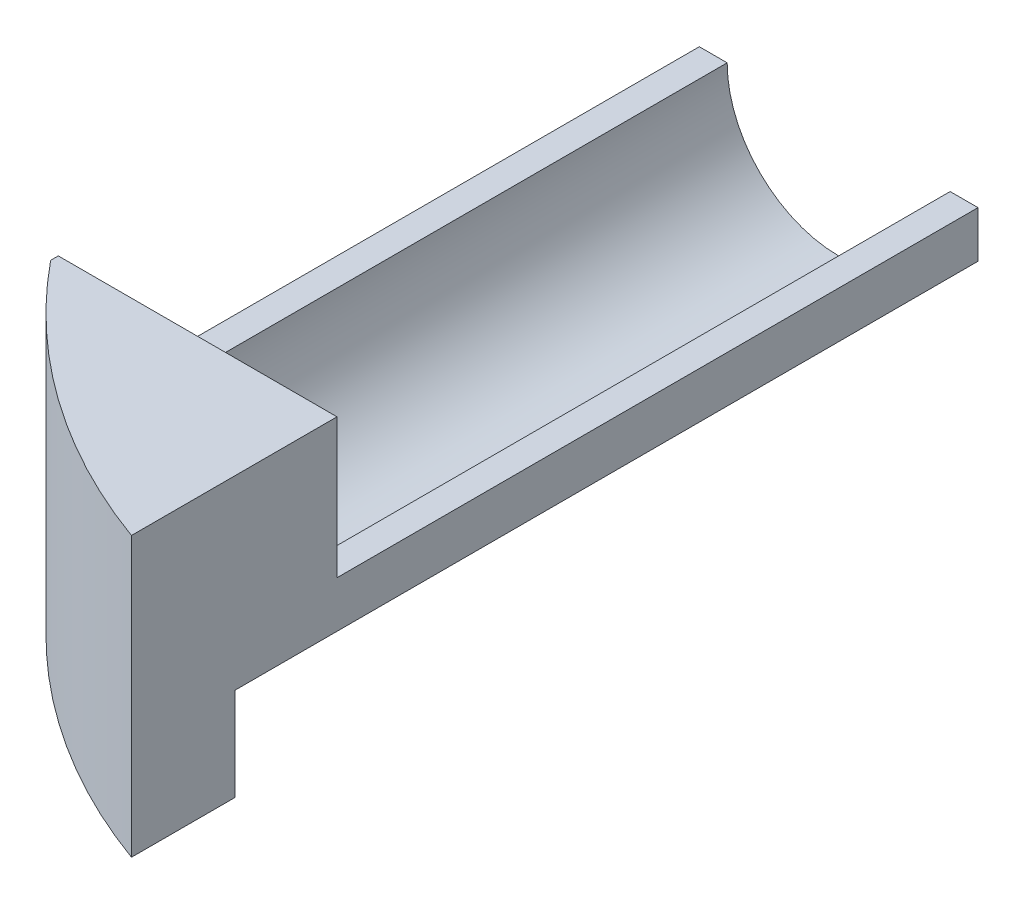
ISO-10303-21;
HEADER;
FILE_DESCRIPTION(('STEP AP214'),'2;1');
FILE_NAME('part.step','',(''),(''),'','','');
FILE_SCHEMA(('AUTOMOTIVE_DESIGN { 1 0 10303 214 1 1 1 1 }'));
ENDSEC;
DATA;
#1=APPLICATION_CONTEXT('core data for automotive mechanical design processes');
#2=APPLICATION_PROTOCOL_DEFINITION('international standard','automotive_design',2000,#1);
#3=PRODUCT_CONTEXT('',#1,'mechanical');
#4=PRODUCT('Part','Part','',(#3));
#5=PRODUCT_RELATED_PRODUCT_CATEGORY('part','',(#4));
#6=PRODUCT_DEFINITION_FORMATION('','',#4);
#7=PRODUCT_DEFINITION_CONTEXT('part definition',#1,'design');
#8=PRODUCT_DEFINITION('design','',#6,#7);
#9=PRODUCT_DEFINITION_SHAPE('','',#8);
#10=(LENGTH_UNIT() NAMED_UNIT(*) SI_UNIT(.MILLI.,.METRE.));
#11=(NAMED_UNIT(*) PLANE_ANGLE_UNIT() SI_UNIT($,.RADIAN.));
#12=(NAMED_UNIT(*) SI_UNIT($,.STERADIAN.) SOLID_ANGLE_UNIT());
#13=UNCERTAINTY_MEASURE_WITH_UNIT(LENGTH_MEASURE(1.E-05),#10,'distance_accuracy_value','');
#14=(GEOMETRIC_REPRESENTATION_CONTEXT(3) GLOBAL_UNCERTAINTY_ASSIGNED_CONTEXT((#13)) GLOBAL_UNIT_ASSIGNED_CONTEXT((#10,
#11,#12)) REPRESENTATION_CONTEXT('',''));
#15=CARTESIAN_POINT('',(0.,0.,0.));
#16=DIRECTION('',(0.,0.,1.));
#17=DIRECTION('',(1.,0.,0.));
#18=AXIS2_PLACEMENT_3D('',#15,#16,#17);
#19=CARTESIAN_POINT('',(-30.,30.,100.));
#20=DIRECTION('',(0.,-1.,0.));
#21=DIRECTION('',(0.,0.,-1.));
#22=AXIS2_PLACEMENT_3D('',#19,#20,#21);
#23=PLANE('',#22);
#24=DIRECTION('',(1.,0.,0.));
#25=VECTOR('',#24,1.);
#26=CARTESIAN_POINT('',(0.,30.,69.));
#27=LINE('',#26,#25);
#28=CARTESIAN_POINT('',(-30.,30.,69.));
#29=VERTEX_POINT('',#28);
#30=CARTESIAN_POINT('',(0.,30.,69.));
#31=VERTEX_POINT('',#30);
#32=EDGE_CURVE('E166',#29,#31,#27,.T.);
#33=ORIENTED_EDGE('',*,*,#32,.F.);
#34=DIRECTION('',(0.,0.,-1.));
#35=VECTOR('',#34,1.);
#36=CARTESIAN_POINT('',(-30.,30.,100.));
#37=LINE('',#36,#35);
#38=CARTESIAN_POINT('',(-30.,30.,69.8246485929605));
#39=VERTEX_POINT('',#38);
#40=EDGE_CURVE('E55',#39,#29,#37,.T.);
#41=ORIENTED_EDGE('',*,*,#40,.F.);
#42=CARTESIAN_POINT('',(23.5,30.,26.25));
#43=DIRECTION('',(0.,-1.,0.));
#44=DIRECTION('',(1.,0.,0.));
#45=AXIS2_PLACEMENT_3D('',#42,#43,#44);
#46=CIRCLE('',#45,69.);
#47=CARTESIAN_POINT('',(0.,30.,91.1248795759961));
#48=VERTEX_POINT('',#47);
#49=EDGE_CURVE('E199',#48,#39,#46,.T.);
#50=ORIENTED_EDGE('',*,*,#49,.F.);
#51=DIRECTION('',(0.,0.,-1.));
#52=VECTOR('',#51,1.);
#53=CARTESIAN_POINT('',(0.,30.,100.));
#54=LINE('',#53,#52);
#55=EDGE_CURVE('E12',#48,#31,#54,.T.);
#56=ORIENTED_EDGE('',*,*,#55,.T.);
#57=EDGE_LOOP('',(#33,#41,#50,#56));
#58=FACE_BOUND('',#57,.T.);
#59=ADVANCED_FACE('F46',(#58),#23,.F.);
#60=CARTESIAN_POINT('',(0.,30.,100.));
#61=DIRECTION('',(-1.,0.,0.));
#62=DIRECTION('',(0.,-1.,0.));
#63=AXIS2_PLACEMENT_3D('',#60,#61,#62);
#64=PLANE('',#63);
#65=DIRECTION('',(0.,-1.,0.));
#66=VECTOR('',#65,1.);
#67=CARTESIAN_POINT('',(0.,0.,80.));
#68=LINE('',#67,#66);
#69=CARTESIAN_POINT('',(0.,10.,80.));
#70=VERTEX_POINT('',#69);
#71=CARTESIAN_POINT('',(0.,0.,80.));
#72=VERTEX_POINT('',#71);
#73=EDGE_CURVE('E130',#70,#72,#68,.T.);
#74=ORIENTED_EDGE('',*,*,#73,.F.);
#75=DIRECTION('',(0.,0.,-1.));
#76=VECTOR('',#75,1.);
#77=CARTESIAN_POINT('',(0.,10.,80.));
#78=LINE('',#77,#76);
#79=CARTESIAN_POINT('',(0.,10.,0.));
#80=VERTEX_POINT('',#79);
#81=EDGE_CURVE('E126',#70,#80,#78,.T.);
#82=ORIENTED_EDGE('',*,*,#81,.T.);
#83=DIRECTION('',(0.,1.,0.));
#84=VECTOR('',#83,1.);
#85=CARTESIAN_POINT('',(0.,30.,0.));
#86=LINE('',#85,#84);
#87=CARTESIAN_POINT('',(0.,15.,0.));
#88=VERTEX_POINT('',#87);
#89=EDGE_CURVE('E211',#80,#88,#86,.T.);
#90=ORIENTED_EDGE('',*,*,#89,.T.);
#91=DIRECTION('',(0.,0.,-1.));
#92=VECTOR('',#91,1.);
#93=CARTESIAN_POINT('',(0.,15.,69.));
#94=LINE('',#93,#92);
#95=CARTESIAN_POINT('',(0.,15.,69.));
#96=VERTEX_POINT('',#95);
#97=EDGE_CURVE('E189',#96,#88,#94,.T.);
#98=ORIENTED_EDGE('',*,*,#97,.F.);
#99=DIRECTION('',(0.,-1.,0.));
#100=VECTOR('',#99,1.);
#101=CARTESIAN_POINT('',(0.,15.,69.));
#102=LINE('',#101,#100);
#103=EDGE_CURVE('E169',#31,#96,#102,.T.);
#104=ORIENTED_EDGE('',*,*,#103,.F.);
#105=ORIENTED_EDGE('',*,*,#55,.F.);
#106=DIRECTION('',(0.,-1.,0.));
#107=VECTOR('',#106,1.);
#108=CARTESIAN_POINT('',(0.,30.,91.1248795759961));
#109=LINE('',#108,#107);
#110=CARTESIAN_POINT('',(0.,0.,91.1248795759961));
#111=VERTEX_POINT('',#110);
#112=EDGE_CURVE('E208',#111,#48,#109,.F.);
#113=ORIENTED_EDGE('',*,*,#112,.F.);
#114=DIRECTION('',(0.,0.,-1.));
#115=VECTOR('',#114,1.);
#116=CARTESIAN_POINT('',(0.,0.,100.));
#117=LINE('',#116,#115);
#118=EDGE_CURVE('E219',#111,#72,#117,.T.);
#119=ORIENTED_EDGE('',*,*,#118,.T.);
#120=EDGE_LOOP('',(#74,#82,#90,#98,#104,#105,#113,#119));
#121=FACE_BOUND('',#120,.T.);
#122=ADVANCED_FACE('F48',(#121),#64,.F.);
#123=CARTESIAN_POINT('',(-30.,0.,100.));
#124=DIRECTION('',(1.,0.,0.));
#125=DIRECTION('',(0.,0.,-1.));
#126=AXIS2_PLACEMENT_3D('',#123,#124,#125);
#127=PLANE('',#126);
#128=DIRECTION('',(0.,1.,0.));
#129=VECTOR('',#128,1.);
#130=CARTESIAN_POINT('',(-30.,30.,69.));
#131=LINE('',#130,#129);
#132=CARTESIAN_POINT('',(-30.,15.,69.));
#133=VERTEX_POINT('',#132);
#134=EDGE_CURVE('E163',#133,#29,#131,.T.);
#135=ORIENTED_EDGE('',*,*,#134,.F.);
#136=DIRECTION('',(0.,0.,-1.));
#137=VECTOR('',#136,1.);
#138=CARTESIAN_POINT('',(-30.,15.,69.));
#139=LINE('',#138,#137);
#140=CARTESIAN_POINT('',(-30.,15.,0.));
#141=VERTEX_POINT('',#140);
#142=EDGE_CURVE('E193',#133,#141,#139,.T.);
#143=ORIENTED_EDGE('',*,*,#142,.T.);
#144=DIRECTION('',(0.,-1.,0.));
#145=VECTOR('',#144,1.);
#146=CARTESIAN_POINT('',(-30.,0.,0.));
#147=LINE('',#146,#145);
#148=CARTESIAN_POINT('',(-30.,0.,0.));
#149=VERTEX_POINT('',#148);
#150=EDGE_CURVE('E214',#141,#149,#147,.T.);
#151=ORIENTED_EDGE('',*,*,#150,.T.);
#152=DIRECTION('',(0.,0.,-1.));
#153=VECTOR('',#152,1.);
#154=CARTESIAN_POINT('',(-30.,0.,100.));
#155=LINE('',#154,#153);
#156=CARTESIAN_POINT('',(-30.,0.,69.8246485929605));
#157=VERTEX_POINT('',#156);
#158=EDGE_CURVE('E222',#157,#149,#155,.T.);
#159=ORIENTED_EDGE('',*,*,#158,.F.);
#160=DIRECTION('',(0.,-1.,0.));
#161=VECTOR('',#160,1.);
#162=CARTESIAN_POINT('',(-30.,30.,69.8246485929605));
#163=LINE('',#162,#161);
#164=EDGE_CURVE('E202',#39,#157,#163,.T.);
#165=ORIENTED_EDGE('',*,*,#164,.F.);
#166=ORIENTED_EDGE('',*,*,#40,.T.);
#167=EDGE_LOOP('',(#135,#143,#151,#159,#165,#166));
#168=FACE_BOUND('',#167,.T.);
#169=ADVANCED_FACE('F230',(#168),#127,.F.);
#170=CARTESIAN_POINT('',(0.,0.,100.));
#171=DIRECTION('',(0.,1.,0.));
#172=DIRECTION('',(-1.,0.,0.));
#173=AXIS2_PLACEMENT_3D('',#170,#171,#172);
#174=PLANE('',#173);
#175=DIRECTION('',(1.,0.,0.));
#176=VECTOR('',#175,1.);
#177=CARTESIAN_POINT('',(0.,0.,0.));
#178=LINE('',#177,#176);
#179=CARTESIAN_POINT('',(-10.,0.,0.));
#180=VERTEX_POINT('',#179);
#181=EDGE_CURVE('E145',#149,#180,#178,.T.);
#182=ORIENTED_EDGE('',*,*,#181,.T.);
#183=DIRECTION('',(0.,0.,-1.));
#184=VECTOR('',#183,1.);
#185=CARTESIAN_POINT('',(-10.,0.,80.));
#186=LINE('',#185,#184);
#187=CARTESIAN_POINT('',(-10.,0.,80.));
#188=VERTEX_POINT('',#187);
#189=EDGE_CURVE('E62',#188,#180,#186,.T.);
#190=ORIENTED_EDGE('',*,*,#189,.F.);
#191=DIRECTION('',(-1.,0.,0.));
#192=VECTOR('',#191,1.);
#193=CARTESIAN_POINT('',(-10.,0.,80.));
#194=LINE('',#193,#192);
#195=EDGE_CURVE('E131',#72,#188,#194,.T.);
#196=ORIENTED_EDGE('',*,*,#195,.F.);
#197=ORIENTED_EDGE('',*,*,#118,.F.);
#198=CARTESIAN_POINT('',(23.5,0.,26.25));
#199=DIRECTION('',(0.,-1.,0.));
#200=DIRECTION('',(1.,0.,0.));
#201=AXIS2_PLACEMENT_3D('',#198,#199,#200);
#202=CIRCLE('',#201,69.);
#203=EDGE_CURVE('E188',#111,#157,#202,.T.);
#204=ORIENTED_EDGE('',*,*,#203,.T.);
#205=ORIENTED_EDGE('',*,*,#158,.T.);
#206=EDGE_LOOP('',(#182,#190,#196,#197,#204,#205));
#207=FACE_BOUND('',#206,.T.);
#208=ADVANCED_FACE('F142',(#207),#174,.F.);
#209=CARTESIAN_POINT('',(0.,0.,0.));
#210=DIRECTION('',(0.,0.,-1.));
#211=DIRECTION('',(-1.,0.,0.));
#212=AXIS2_PLACEMENT_3D('',#209,#210,#211);
#213=PLANE('',#212);
#214=DIRECTION('',(0.707106781186547,0.707106781186548,0.));
#215=VECTOR('',#214,1.);
#216=CARTESIAN_POINT('',(0.,10.,0.));
#217=LINE('',#216,#215);
#218=EDGE_CURVE('E139',#180,#80,#217,.T.);
#219=ORIENTED_EDGE('',*,*,#218,.F.);
#220=ORIENTED_EDGE('',*,*,#181,.F.);
#221=ORIENTED_EDGE('',*,*,#150,.F.);
#222=DIRECTION('',(-1.,0.,0.));
#223=VECTOR('',#222,1.);
#224=CARTESIAN_POINT('',(-30.,15.,0.));
#225=LINE('',#224,#223);
#226=CARTESIAN_POINT('',(-27.,15.,0.));
#227=VERTEX_POINT('',#226);
#228=EDGE_CURVE('E179',#227,#141,#225,.T.);
#229=ORIENTED_EDGE('',*,*,#228,.F.);
#230=CARTESIAN_POINT('',(-15.,15.,0.));
#231=DIRECTION('',(0.,0.,-1.));
#232=DIRECTION('',(-1.,0.,0.));
#233=AXIS2_PLACEMENT_3D('',#230,#231,#232);
#234=CIRCLE('',#233,12.);
#235=CARTESIAN_POINT('',(-3.,15.,0.));
#236=VERTEX_POINT('',#235);
#237=EDGE_CURVE('E70',#236,#227,#234,.T.);
#238=ORIENTED_EDGE('',*,*,#237,.F.);
#239=DIRECTION('',(-1.,0.,0.));
#240=VECTOR('',#239,1.);
#241=CARTESIAN_POINT('',(-3.,15.,0.));
#242=LINE('',#241,#240);
#243=EDGE_CURVE('E159',#88,#236,#242,.T.);
#244=ORIENTED_EDGE('',*,*,#243,.F.);
#245=ORIENTED_EDGE('',*,*,#89,.F.);
#246=EDGE_LOOP('',(#219,#220,#221,#229,#238,#244,#245));
#247=FACE_BOUND('',#246,.T.);
#248=ADVANCED_FACE('F248',(#247),#213,.T.);
#249=CARTESIAN_POINT('',(23.5,30.,26.25));
#250=DIRECTION('',(0.,-1.,0.));
#251=DIRECTION('',(1.,0.,0.));
#252=AXIS2_PLACEMENT_3D('',#249,#250,#251);
#253=CYLINDRICAL_SURFACE('',#252,69.);
#254=ORIENTED_EDGE('',*,*,#112,.T.);
#255=ORIENTED_EDGE('',*,*,#49,.T.);
#256=ORIENTED_EDGE('',*,*,#164,.T.);
#257=ORIENTED_EDGE('',*,*,#203,.F.);
#258=EDGE_LOOP('',(#254,#255,#256,#257));
#259=FACE_BOUND('',#258,.T.);
#260=ADVANCED_FACE('F256',(#259),#253,.T.);
#261=CARTESIAN_POINT('',(-15.,15.,69.));
#262=DIRECTION('',(0.,0.,-1.));
#263=DIRECTION('',(-1.,0.,0.));
#264=AXIS2_PLACEMENT_3D('',#261,#262,#263);
#265=CYLINDRICAL_SURFACE('',#264,12.);
#266=ORIENTED_EDGE('',*,*,#237,.T.);
#267=DIRECTION('',(0.,0.,-1.));
#268=VECTOR('',#267,1.);
#269=CARTESIAN_POINT('',(-27.,15.,69.));
#270=LINE('',#269,#268);
#271=CARTESIAN_POINT('',(-27.,15.,69.));
#272=VERTEX_POINT('',#271);
#273=EDGE_CURVE('E176',#272,#227,#270,.T.);
#274=ORIENTED_EDGE('',*,*,#273,.F.);
#275=CARTESIAN_POINT('',(-15.,15.,69.));
#276=DIRECTION('',(0.,0.,-1.));
#277=DIRECTION('',(-1.,0.,0.));
#278=AXIS2_PLACEMENT_3D('',#275,#276,#277);
#279=CIRCLE('',#278,12.);
#280=CARTESIAN_POINT('',(-3.,15.,69.));
#281=VERTEX_POINT('',#280);
#282=EDGE_CURVE('E154',#281,#272,#279,.T.);
#283=ORIENTED_EDGE('',*,*,#282,.F.);
#284=DIRECTION('',(0.,0.,-1.));
#285=VECTOR('',#284,1.);
#286=CARTESIAN_POINT('',(-3.,15.,69.));
#287=LINE('',#286,#285);
#288=EDGE_CURVE('E185',#281,#236,#287,.T.);
#289=ORIENTED_EDGE('',*,*,#288,.T.);
#290=EDGE_LOOP('',(#266,#274,#283,#289));
#291=FACE_BOUND('',#290,.T.);
#292=ADVANCED_FACE('F258',(#291),#265,.F.);
#293=CARTESIAN_POINT('',(-3.,15.,69.));
#294=DIRECTION('',(0.,-1.,0.));
#295=DIRECTION('',(1.,0.,0.));
#296=AXIS2_PLACEMENT_3D('',#293,#294,#295);
#297=PLANE('',#296);
#298=ORIENTED_EDGE('',*,*,#243,.T.);
#299=ORIENTED_EDGE('',*,*,#288,.F.);
#300=DIRECTION('',(-1.,0.,0.));
#301=VECTOR('',#300,1.);
#302=CARTESIAN_POINT('',(-3.,15.,69.));
#303=LINE('',#302,#301);
#304=EDGE_CURVE('E172',#96,#281,#303,.T.);
#305=ORIENTED_EDGE('',*,*,#304,.F.);
#306=ORIENTED_EDGE('',*,*,#97,.T.);
#307=EDGE_LOOP('',(#298,#299,#305,#306));
#308=FACE_BOUND('',#307,.T.);
#309=ADVANCED_FACE('F246',(#308),#297,.F.);
#310=CARTESIAN_POINT('',(-30.,15.,69.));
#311=DIRECTION('',(0.,-1.,0.));
#312=DIRECTION('',(0.,0.,-1.));
#313=AXIS2_PLACEMENT_3D('',#310,#311,#312);
#314=PLANE('',#313);
#315=ORIENTED_EDGE('',*,*,#228,.T.);
#316=ORIENTED_EDGE('',*,*,#142,.F.);
#317=DIRECTION('',(-1.,0.,0.));
#318=VECTOR('',#317,1.);
#319=CARTESIAN_POINT('',(-30.,15.,69.));
#320=LINE('',#319,#318);
#321=EDGE_CURVE('E158',#272,#133,#320,.T.);
#322=ORIENTED_EDGE('',*,*,#321,.F.);
#323=ORIENTED_EDGE('',*,*,#273,.T.);
#324=EDGE_LOOP('',(#315,#316,#322,#323));
#325=FACE_BOUND('',#324,.T.);
#326=ADVANCED_FACE('F252',(#325),#314,.F.);
#327=CARTESIAN_POINT('',(-15.,15.,69.));
#328=DIRECTION('',(0.,0.,-1.));
#329=DIRECTION('',(-1.,0.,0.));
#330=AXIS2_PLACEMENT_3D('',#327,#328,#329);
#331=PLANE('',#330);
#332=ORIENTED_EDGE('',*,*,#282,.T.);
#333=ORIENTED_EDGE('',*,*,#321,.T.);
#334=ORIENTED_EDGE('',*,*,#134,.T.);
#335=ORIENTED_EDGE('',*,*,#32,.T.);
#336=ORIENTED_EDGE('',*,*,#103,.T.);
#337=ORIENTED_EDGE('',*,*,#304,.T.);
#338=EDGE_LOOP('',(#332,#333,#334,#335,#336,#337));
#339=FACE_BOUND('',#338,.T.);
#340=ADVANCED_FACE('F238',(#339),#331,.T.);
#341=CARTESIAN_POINT('',(0.,10.,80.));
#342=DIRECTION('',(-0.707106781186548,0.707106781186547,0.));
#343=DIRECTION('',(-0.707106781186547,-0.707106781186548,0.));
#344=AXIS2_PLACEMENT_3D('',#341,#342,#343);
#345=PLANE('',#344);
#346=ORIENTED_EDGE('',*,*,#218,.T.);
#347=ORIENTED_EDGE('',*,*,#81,.F.);
#348=DIRECTION('',(0.707106781186547,0.707106781186548,0.));
#349=VECTOR('',#348,1.);
#350=CARTESIAN_POINT('',(0.,10.,80.));
#351=LINE('',#350,#349);
#352=EDGE_CURVE('E122',#188,#70,#351,.T.);
#353=ORIENTED_EDGE('',*,*,#352,.F.);
#354=ORIENTED_EDGE('',*,*,#189,.T.);
#355=EDGE_LOOP('',(#346,#347,#353,#354));
#356=FACE_BOUND('',#355,.T.);
#357=ADVANCED_FACE('F124',(#356),#345,.F.);
#358=CARTESIAN_POINT('',(0.,0.,80.));
#359=DIRECTION('',(0.,0.,1.));
#360=DIRECTION('',(1.,0.,0.));
#361=AXIS2_PLACEMENT_3D('',#358,#359,#360);
#362=PLANE('',#361);
#363=ORIENTED_EDGE('',*,*,#195,.T.);
#364=ORIENTED_EDGE('',*,*,#352,.T.);
#365=ORIENTED_EDGE('',*,*,#73,.T.);
#366=EDGE_LOOP('',(#363,#364,#365));
#367=FACE_BOUND('',#366,.T.);
#368=ADVANCED_FACE('F134',(#367),#362,.F.);
#369=CLOSED_SHELL('',(#59,#122,#169,#208,#248,#260,#292,#309,#326,#340,#357,#368));
#370=MANIFOLD_SOLID_BREP('B2',#369);
#371=ADVANCED_BREP_SHAPE_REPRESENTATION('',(#18,#370),#14);
#372=SHAPE_DEFINITION_REPRESENTATION(#9,#371);
ENDSEC;
END-ISO-10303-21;
